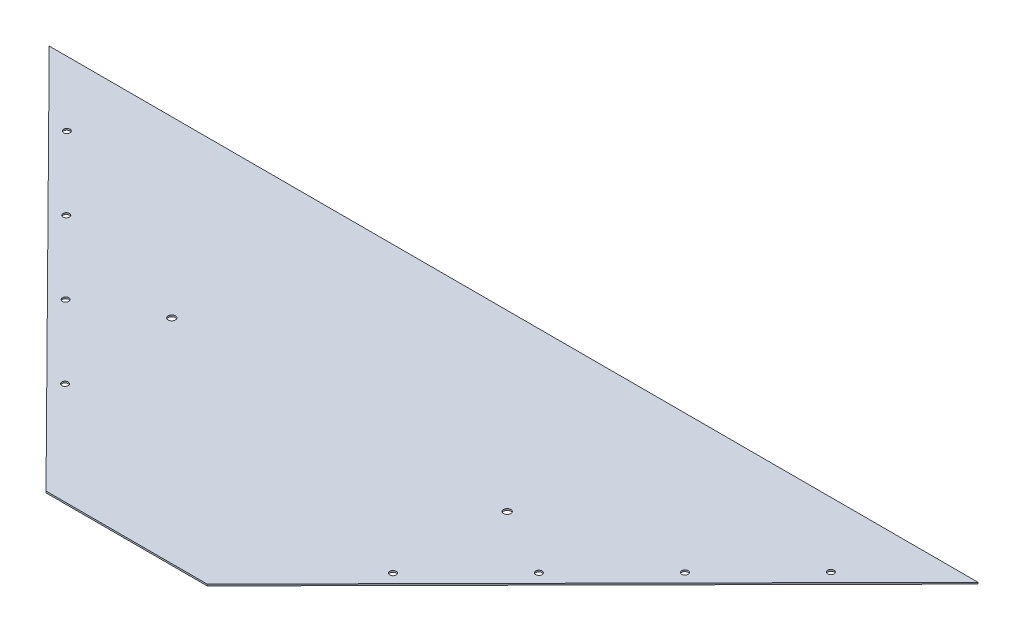
ISO-10303-21;
HEADER;
FILE_DESCRIPTION(('STEP AP214'),'2;1');
FILE_NAME('part.step','',(''),(''),'','','');
FILE_SCHEMA(('AUTOMOTIVE_DESIGN { 1 0 10303 214 1 1 1 1 }'));
ENDSEC;
DATA;
#1=APPLICATION_CONTEXT('core data for automotive mechanical design processes');
#2=APPLICATION_PROTOCOL_DEFINITION('international standard','automotive_design',2000,#1);
#3=PRODUCT_CONTEXT('',#1,'mechanical');
#4=PRODUCT('Part','Part','',(#3));
#5=PRODUCT_RELATED_PRODUCT_CATEGORY('part','',(#4));
#6=PRODUCT_DEFINITION_FORMATION('','',#4);
#7=PRODUCT_DEFINITION_CONTEXT('part definition',#1,'design');
#8=PRODUCT_DEFINITION('design','',#6,#7);
#9=PRODUCT_DEFINITION_SHAPE('','',#8);
#10=(LENGTH_UNIT() NAMED_UNIT(*) SI_UNIT(.MILLI.,.METRE.));
#11=(NAMED_UNIT(*) PLANE_ANGLE_UNIT() SI_UNIT($,.RADIAN.));
#12=(NAMED_UNIT(*) SI_UNIT($,.STERADIAN.) SOLID_ANGLE_UNIT());
#13=UNCERTAINTY_MEASURE_WITH_UNIT(LENGTH_MEASURE(1.E-05),#10,'distance_accuracy_value','');
#14=(GEOMETRIC_REPRESENTATION_CONTEXT(3) GLOBAL_UNCERTAINTY_ASSIGNED_CONTEXT((#13)) GLOBAL_UNIT_ASSIGNED_CONTEXT((#10,
#11,#12)) REPRESENTATION_CONTEXT('',''));
#15=CARTESIAN_POINT('',(0.,0.,0.));
#16=DIRECTION('',(0.,0.,1.));
#17=DIRECTION('',(1.,0.,0.));
#18=AXIS2_PLACEMENT_3D('',#15,#16,#17);
#19=CARTESIAN_POINT('',(-755.65,3.175,-762.));
#20=DIRECTION('',(0.710059171597633,0.,-0.70414201183432));
#21=DIRECTION('',(-0.70414201183432,0.,-0.710059171597633));
#22=AXIS2_PLACEMENT_3D('',#19,#20,#21);
#23=PLANE('',#22);
#24=DIRECTION('',(0.70414201183432,0.,0.710059171597633));
#25=VECTOR('',#24,1.);
#26=CARTESIAN_POINT('',(-755.65,0.,-762.));
#27=LINE('',#26,#25);
#28=CARTESIAN_POINT('',(-755.65,0.,-762.));
#29=VERTEX_POINT('',#28);
#30=CARTESIAN_POINT('',(0.,0.,0.));
#31=VERTEX_POINT('',#30);
#32=EDGE_CURVE('E97',#29,#31,#27,.T.);
#33=ORIENTED_EDGE('',*,*,#32,.T.);
#34=DIRECTION('',(0.,-1.,0.));
#35=VECTOR('',#34,1.);
#36=CARTESIAN_POINT('',(0.,3.175,0.));
#37=LINE('',#36,#35);
#38=CARTESIAN_POINT('',(0.,3.175,0.));
#39=VERTEX_POINT('',#38);
#40=EDGE_CURVE('E11',#39,#31,#37,.T.);
#41=ORIENTED_EDGE('',*,*,#40,.F.);
#42=DIRECTION('',(0.70414201183432,0.,0.710059171597633));
#43=VECTOR('',#42,1.);
#44=CARTESIAN_POINT('',(-755.65,3.175,-762.));
#45=LINE('',#44,#43);
#46=CARTESIAN_POINT('',(-755.65,3.175,-762.));
#47=VERTEX_POINT('',#46);
#48=EDGE_CURVE('E85',#47,#39,#45,.T.);
#49=ORIENTED_EDGE('',*,*,#48,.F.);
#50=DIRECTION('',(0.,-1.,0.));
#51=VECTOR('',#50,1.);
#52=CARTESIAN_POINT('',(-755.65,3.175,-762.));
#53=LINE('',#52,#51);
#54=EDGE_CURVE('E93',#47,#29,#53,.T.);
#55=ORIENTED_EDGE('',*,*,#54,.T.);
#56=EDGE_LOOP('',(#33,#41,#49,#55));
#57=FACE_BOUND('',#56,.T.);
#58=ADVANCED_FACE('F34',(#57),#23,.F.);
#59=CARTESIAN_POINT('',(0.,3.175,0.));
#60=DIRECTION('',(0.,0.,-1.));
#61=DIRECTION('',(-1.,0.,0.));
#62=AXIS2_PLACEMENT_3D('',#59,#60,#61);
#63=PLANE('',#62);
#64=DIRECTION('',(1.,0.,0.));
#65=VECTOR('',#64,1.);
#66=CARTESIAN_POINT('',(0.,0.,0.));
#67=LINE('',#66,#65);
#68=CARTESIAN_POINT('',(317.5,0.,0.));
#69=VERTEX_POINT('',#68);
#70=EDGE_CURVE('E89',#31,#69,#67,.T.);
#71=ORIENTED_EDGE('',*,*,#70,.T.);
#72=DIRECTION('',(0.,-1.,0.));
#73=VECTOR('',#72,1.);
#74=CARTESIAN_POINT('',(317.5,3.175,0.));
#75=LINE('',#74,#73);
#76=CARTESIAN_POINT('',(317.5,3.175,0.));
#77=VERTEX_POINT('',#76);
#78=EDGE_CURVE('E42',#77,#69,#75,.T.);
#79=ORIENTED_EDGE('',*,*,#78,.F.);
#80=DIRECTION('',(1.,0.,0.));
#81=VECTOR('',#80,1.);
#82=CARTESIAN_POINT('',(0.,3.175,0.));
#83=LINE('',#82,#81);
#84=EDGE_CURVE('E80',#39,#77,#83,.T.);
#85=ORIENTED_EDGE('',*,*,#84,.F.);
#86=ORIENTED_EDGE('',*,*,#40,.T.);
#87=EDGE_LOOP('',(#71,#79,#85,#86));
#88=FACE_BOUND('',#87,.T.);
#89=ADVANCED_FACE('F88',(#88),#63,.F.);
#90=CARTESIAN_POINT('',(1073.15,3.175,-762.));
#91=DIRECTION('',(-0.710059171597633,0.,-0.704142011834319));
#92=DIRECTION('',(-0.704142011834319,0.,0.710059171597633));
#93=AXIS2_PLACEMENT_3D('',#90,#91,#92);
#94=PLANE('',#93);
#95=DIRECTION('',(0.704142011834319,0.,-0.710059171597633));
#96=VECTOR('',#95,1.);
#97=CARTESIAN_POINT('',(1073.15,0.,-762.));
#98=LINE('',#97,#96);
#99=CARTESIAN_POINT('',(1073.15,0.,-762.));
#100=VERTEX_POINT('',#99);
#101=EDGE_CURVE('E67',#69,#100,#98,.T.);
#102=ORIENTED_EDGE('',*,*,#101,.T.);
#103=DIRECTION('',(0.,-1.,0.));
#104=VECTOR('',#103,1.);
#105=CARTESIAN_POINT('',(1073.15,3.175,-762.));
#106=LINE('',#105,#104);
#107=CARTESIAN_POINT('',(1073.15,3.175,-762.));
#108=VERTEX_POINT('',#107);
#109=EDGE_CURVE('E90',#108,#100,#106,.T.);
#110=ORIENTED_EDGE('',*,*,#109,.F.);
#111=DIRECTION('',(0.704142011834319,0.,-0.710059171597633));
#112=VECTOR('',#111,1.);
#113=CARTESIAN_POINT('',(1073.15,3.175,-762.));
#114=LINE('',#113,#112);
#115=EDGE_CURVE('E83',#77,#108,#114,.T.);
#116=ORIENTED_EDGE('',*,*,#115,.F.);
#117=ORIENTED_EDGE('',*,*,#78,.T.);
#118=EDGE_LOOP('',(#102,#110,#116,#117));
#119=FACE_BOUND('',#118,.T.);
#120=ADVANCED_FACE('F91',(#119),#94,.F.);
#121=CARTESIAN_POINT('',(1073.15,3.175,-762.));
#122=DIRECTION('',(0.,0.,1.));
#123=DIRECTION('',(1.,0.,0.));
#124=AXIS2_PLACEMENT_3D('',#121,#122,#123);
#125=PLANE('',#124);
#126=DIRECTION('',(-1.,0.,0.));
#127=VECTOR('',#126,1.);
#128=CARTESIAN_POINT('',(1073.15,0.,-762.));
#129=LINE('',#128,#127);
#130=EDGE_CURVE('E73',#100,#29,#129,.T.);
#131=ORIENTED_EDGE('',*,*,#130,.T.);
#132=ORIENTED_EDGE('',*,*,#54,.F.);
#133=DIRECTION('',(-1.,0.,0.));
#134=VECTOR('',#133,1.);
#135=CARTESIAN_POINT('',(1073.15,3.175,-762.));
#136=LINE('',#135,#134);
#137=EDGE_CURVE('E50',#108,#47,#136,.T.);
#138=ORIENTED_EDGE('',*,*,#137,.F.);
#139=ORIENTED_EDGE('',*,*,#109,.T.);
#140=EDGE_LOOP('',(#131,#132,#138,#139));
#141=FACE_BOUND('',#140,.T.);
#142=ADVANCED_FACE('F105',(#141),#125,.F.);
#143=CARTESIAN_POINT('',(158.75,3.175,160.084033613445));
#144=DIRECTION('',(0.,-1.,0.));
#145=DIRECTION('',(0.,0.,-1.));
#146=AXIS2_PLACEMENT_3D('',#143,#144,#145);
#147=PLANE('',#146);
#148=CARTESIAN_POINT('',(910.902017408381,3.175,-634.460857890803));
#149=DIRECTION('',(0.,1.,0.));
#150=DIRECTION('',(0.,0.,-1.));
#151=AXIS2_PLACEMENT_3D('',#148,#149,#150);
#152=CIRCLE('',#151,6.34999999999994);
#153=CARTESIAN_POINT('',(910.902017408381,3.175,-640.810857890803));
#154=VERTEX_POINT('',#153);
#155=EDGE_CURVE('E165',#154,#154,#152,.T.);
#156=ORIENTED_EDGE('',*,*,#155,.F.);
#157=EDGE_LOOP('',(#156));
#158=FACE_BOUND('',#157,.T.);
#159=CARTESIAN_POINT('',(767.820360603647,3.175,-490.176834222165));
#160=DIRECTION('',(0.,1.,0.));
#161=DIRECTION('',(0.,0.,-1.));
#162=AXIS2_PLACEMENT_3D('',#159,#160,#161);
#163=CIRCLE('',#162,6.34999999999994);
#164=CARTESIAN_POINT('',(767.820360603647,3.175,-496.526834222164));
#165=VERTEX_POINT('',#164);
#166=EDGE_CURVE('E159',#165,#165,#163,.T.);
#167=ORIENTED_EDGE('',*,*,#166,.F.);
#168=EDGE_LOOP('',(#167));
#169=FACE_BOUND('',#168,.T.);
#170=CARTESIAN_POINT('',(624.738703798914,3.175,-345.892810553526));
#171=DIRECTION('',(0.,1.,0.));
#172=DIRECTION('',(0.,0.,-1.));
#173=AXIS2_PLACEMENT_3D('',#170,#171,#172);
#174=CIRCLE('',#173,6.34999999999994);
#175=CARTESIAN_POINT('',(624.738703798914,3.175,-352.242810553526));
#176=VERTEX_POINT('',#175);
#177=EDGE_CURVE('E153',#176,#176,#174,.T.);
#178=ORIENTED_EDGE('',*,*,#177,.F.);
#179=EDGE_LOOP('',(#178));
#180=FACE_BOUND('',#179,.T.);
#181=CARTESIAN_POINT('',(481.65704699418,3.175,-201.608786884887));
#182=DIRECTION('',(0.,1.,0.));
#183=DIRECTION('',(0.,0.,-1.));
#184=AXIS2_PLACEMENT_3D('',#181,#182,#183);
#185=CIRCLE('',#184,6.34999999999994);
#186=CARTESIAN_POINT('',(481.65704699418,3.175,-207.958786884887));
#187=VERTEX_POINT('',#186);
#188=EDGE_CURVE('E147',#187,#187,#185,.T.);
#189=ORIENTED_EDGE('',*,*,#188,.F.);
#190=EDGE_LOOP('',(#189));
#191=FACE_BOUND('',#190,.T.);
#192=CARTESIAN_POINT('',(-164.15704699418,3.175,-201.608786884887));
#193=DIRECTION('',(0.,1.,0.));
#194=DIRECTION('',(0.,0.,1.));
#195=AXIS2_PLACEMENT_3D('',#192,#193,#194);
#196=CIRCLE('',#195,6.34999999999994);
#197=CARTESIAN_POINT('',(-164.15704699418,3.175,-195.258786884887));
#198=VERTEX_POINT('',#197);
#199=EDGE_CURVE('E141',#198,#198,#196,.T.);
#200=ORIENTED_EDGE('',*,*,#199,.F.);
#201=EDGE_LOOP('',(#200));
#202=FACE_BOUND('',#201,.T.);
#203=CARTESIAN_POINT('',(-307.238703798914,3.175,-345.892810553526));
#204=DIRECTION('',(0.,1.,0.));
#205=DIRECTION('',(0.,0.,1.));
#206=AXIS2_PLACEMENT_3D('',#203,#204,#205);
#207=CIRCLE('',#206,6.34999999999994);
#208=CARTESIAN_POINT('',(-307.238703798914,3.175,-339.542810553526));
#209=VERTEX_POINT('',#208);
#210=EDGE_CURVE('E135',#209,#209,#207,.T.);
#211=ORIENTED_EDGE('',*,*,#210,.F.);
#212=EDGE_LOOP('',(#211));
#213=FACE_BOUND('',#212,.T.);
#214=CARTESIAN_POINT('',(-450.320360603647,3.175,-490.176834222165));
#215=DIRECTION('',(0.,1.,0.));
#216=DIRECTION('',(0.,0.,1.));
#217=AXIS2_PLACEMENT_3D('',#214,#215,#216);
#218=CIRCLE('',#217,6.34999999999994);
#219=CARTESIAN_POINT('',(-450.320360603647,3.175,-483.826834222165));
#220=VERTEX_POINT('',#219);
#221=EDGE_CURVE('E129',#220,#220,#218,.T.);
#222=ORIENTED_EDGE('',*,*,#221,.F.);
#223=EDGE_LOOP('',(#222));
#224=FACE_BOUND('',#223,.T.);
#225=CARTESIAN_POINT('',(-593.402017408381,3.175,-634.460857890804));
#226=DIRECTION('',(0.,1.,0.));
#227=DIRECTION('',(0.,0.,1.));
#228=AXIS2_PLACEMENT_3D('',#225,#226,#227);
#229=CIRCLE('',#228,6.34999999999994);
#230=CARTESIAN_POINT('',(-593.402017408381,3.175,-628.110857890804));
#231=VERTEX_POINT('',#230);
#232=EDGE_CURVE('E123',#231,#231,#229,.T.);
#233=ORIENTED_EDGE('',*,*,#232,.F.);
#234=EDGE_LOOP('',(#233));
#235=FACE_BOUND('',#234,.T.);
#236=CARTESIAN_POINT('',(488.95,3.175,-419.1));
#237=DIRECTION('',(0.,1.,0.));
#238=DIRECTION('',(0.,0.,1.));
#239=AXIS2_PLACEMENT_3D('',#236,#237,#238);
#240=CIRCLE('',#239,7.14374999999995);
#241=CARTESIAN_POINT('',(488.95,3.175,-411.95625));
#242=VERTEX_POINT('',#241);
#243=EDGE_CURVE('E114',#242,#242,#240,.T.);
#244=ORIENTED_EDGE('',*,*,#243,.F.);
#245=EDGE_LOOP('',(#244));
#246=FACE_BOUND('',#245,.T.);
#247=CARTESIAN_POINT('',(-171.45,3.175,-419.1));
#248=DIRECTION('',(0.,1.,0.));
#249=DIRECTION('',(0.,0.,1.));
#250=AXIS2_PLACEMENT_3D('',#247,#248,#249);
#251=CIRCLE('',#250,7.14374999999993);
#252=CARTESIAN_POINT('',(-171.45,3.175,-411.95625));
#253=VERTEX_POINT('',#252);
#254=EDGE_CURVE('E100',#253,#253,#251,.T.);
#255=ORIENTED_EDGE('',*,*,#254,.F.);
#256=EDGE_LOOP('',(#255));
#257=FACE_BOUND('',#256,.T.);
#258=ORIENTED_EDGE('',*,*,#48,.T.);
#259=ORIENTED_EDGE('',*,*,#84,.T.);
#260=ORIENTED_EDGE('',*,*,#115,.T.);
#261=ORIENTED_EDGE('',*,*,#137,.T.);
#262=EDGE_LOOP('',(#258,#259,#260,#261));
#263=FACE_BOUND('',#262,.T.);
#264=ADVANCED_FACE('F81',(#158,#169,#180,#191,#202,#213,#224,#235,#246,#257,#263),#147,.F.);
#265=CARTESIAN_POINT('',(158.75,0.,160.084033613445));
#266=DIRECTION('',(0.,-1.,0.));
#267=DIRECTION('',(0.,0.,-1.));
#268=AXIS2_PLACEMENT_3D('',#265,#266,#267);
#269=PLANE('',#268);
#270=CARTESIAN_POINT('',(910.902017408381,0.,-634.460857890803));
#271=DIRECTION('',(0.,1.,0.));
#272=DIRECTION('',(0.,0.,-1.));
#273=AXIS2_PLACEMENT_3D('',#270,#271,#272);
#274=CIRCLE('',#273,6.34999999999994);
#275=CARTESIAN_POINT('',(910.902017408381,0.,-640.810857890803));
#276=VERTEX_POINT('',#275);
#277=EDGE_CURVE('E162',#276,#276,#274,.T.);
#278=ORIENTED_EDGE('',*,*,#277,.T.);
#279=EDGE_LOOP('',(#278));
#280=FACE_BOUND('',#279,.T.);
#281=CARTESIAN_POINT('',(767.820360603647,0.,-490.176834222165));
#282=DIRECTION('',(0.,1.,0.));
#283=DIRECTION('',(0.,0.,-1.));
#284=AXIS2_PLACEMENT_3D('',#281,#282,#283);
#285=CIRCLE('',#284,6.34999999999994);
#286=CARTESIAN_POINT('',(767.820360603647,0.,-496.526834222164));
#287=VERTEX_POINT('',#286);
#288=EDGE_CURVE('E156',#287,#287,#285,.T.);
#289=ORIENTED_EDGE('',*,*,#288,.T.);
#290=EDGE_LOOP('',(#289));
#291=FACE_BOUND('',#290,.T.);
#292=CARTESIAN_POINT('',(624.738703798914,0.,-345.892810553526));
#293=DIRECTION('',(0.,1.,0.));
#294=DIRECTION('',(0.,0.,-1.));
#295=AXIS2_PLACEMENT_3D('',#292,#293,#294);
#296=CIRCLE('',#295,6.34999999999994);
#297=CARTESIAN_POINT('',(624.738703798914,0.,-352.242810553526));
#298=VERTEX_POINT('',#297);
#299=EDGE_CURVE('E150',#298,#298,#296,.T.);
#300=ORIENTED_EDGE('',*,*,#299,.T.);
#301=EDGE_LOOP('',(#300));
#302=FACE_BOUND('',#301,.T.);
#303=CARTESIAN_POINT('',(481.65704699418,0.,-201.608786884887));
#304=DIRECTION('',(0.,1.,0.));
#305=DIRECTION('',(0.,0.,-1.));
#306=AXIS2_PLACEMENT_3D('',#303,#304,#305);
#307=CIRCLE('',#306,6.34999999999994);
#308=CARTESIAN_POINT('',(481.65704699418,0.,-207.958786884887));
#309=VERTEX_POINT('',#308);
#310=EDGE_CURVE('E144',#309,#309,#307,.T.);
#311=ORIENTED_EDGE('',*,*,#310,.T.);
#312=EDGE_LOOP('',(#311));
#313=FACE_BOUND('',#312,.T.);
#314=CARTESIAN_POINT('',(-164.15704699418,0.,-201.608786884887));
#315=DIRECTION('',(0.,1.,0.));
#316=DIRECTION('',(0.,0.,1.));
#317=AXIS2_PLACEMENT_3D('',#314,#315,#316);
#318=CIRCLE('',#317,6.34999999999994);
#319=CARTESIAN_POINT('',(-164.15704699418,0.,-195.258786884887));
#320=VERTEX_POINT('',#319);
#321=EDGE_CURVE('E138',#320,#320,#318,.T.);
#322=ORIENTED_EDGE('',*,*,#321,.T.);
#323=EDGE_LOOP('',(#322));
#324=FACE_BOUND('',#323,.T.);
#325=CARTESIAN_POINT('',(-307.238703798914,0.,-345.892810553526));
#326=DIRECTION('',(0.,1.,0.));
#327=DIRECTION('',(0.,0.,1.));
#328=AXIS2_PLACEMENT_3D('',#325,#326,#327);
#329=CIRCLE('',#328,6.34999999999994);
#330=CARTESIAN_POINT('',(-307.238703798914,0.,-339.542810553526));
#331=VERTEX_POINT('',#330);
#332=EDGE_CURVE('E132',#331,#331,#329,.T.);
#333=ORIENTED_EDGE('',*,*,#332,.T.);
#334=EDGE_LOOP('',(#333));
#335=FACE_BOUND('',#334,.T.);
#336=CARTESIAN_POINT('',(-450.320360603647,0.,-490.176834222165));
#337=DIRECTION('',(0.,1.,0.));
#338=DIRECTION('',(0.,0.,1.));
#339=AXIS2_PLACEMENT_3D('',#336,#337,#338);
#340=CIRCLE('',#339,6.34999999999994);
#341=CARTESIAN_POINT('',(-450.320360603647,0.,-483.826834222165));
#342=VERTEX_POINT('',#341);
#343=EDGE_CURVE('E126',#342,#342,#340,.T.);
#344=ORIENTED_EDGE('',*,*,#343,.T.);
#345=EDGE_LOOP('',(#344));
#346=FACE_BOUND('',#345,.T.);
#347=CARTESIAN_POINT('',(-593.402017408381,0.,-634.460857890804));
#348=DIRECTION('',(0.,1.,0.));
#349=DIRECTION('',(0.,0.,1.));
#350=AXIS2_PLACEMENT_3D('',#347,#348,#349);
#351=CIRCLE('',#350,6.34999999999994);
#352=CARTESIAN_POINT('',(-593.402017408381,0.,-628.110857890804));
#353=VERTEX_POINT('',#352);
#354=EDGE_CURVE('E120',#353,#353,#351,.T.);
#355=ORIENTED_EDGE('',*,*,#354,.T.);
#356=EDGE_LOOP('',(#355));
#357=FACE_BOUND('',#356,.T.);
#358=CARTESIAN_POINT('',(488.95,0.,-419.1));
#359=DIRECTION('',(0.,-1.,0.));
#360=DIRECTION('',(0.,0.,-1.));
#361=AXIS2_PLACEMENT_3D('',#358,#359,#360);
#362=CIRCLE('',#361,7.14374999999995);
#363=CARTESIAN_POINT('',(488.95,0.,-426.24375));
#364=VERTEX_POINT('',#363);
#365=EDGE_CURVE('E117',#364,#364,#362,.F.);
#366=ORIENTED_EDGE('',*,*,#365,.T.);
#367=EDGE_LOOP('',(#366));
#368=FACE_BOUND('',#367,.T.);
#369=CARTESIAN_POINT('',(-171.45,0.,-419.1));
#370=DIRECTION('',(0.,-1.,0.));
#371=DIRECTION('',(0.,0.,-1.));
#372=AXIS2_PLACEMENT_3D('',#369,#370,#371);
#373=CIRCLE('',#372,7.14374999999993);
#374=CARTESIAN_POINT('',(-171.45,0.,-426.24375));
#375=VERTEX_POINT('',#374);
#376=EDGE_CURVE('E111',#375,#375,#373,.F.);
#377=ORIENTED_EDGE('',*,*,#376,.T.);
#378=EDGE_LOOP('',(#377));
#379=FACE_BOUND('',#378,.T.);
#380=ORIENTED_EDGE('',*,*,#32,.F.);
#381=ORIENTED_EDGE('',*,*,#130,.F.);
#382=ORIENTED_EDGE('',*,*,#101,.F.);
#383=ORIENTED_EDGE('',*,*,#70,.F.);
#384=EDGE_LOOP('',(#380,#381,#382,#383));
#385=FACE_BOUND('',#384,.T.);
#386=ADVANCED_FACE('F108',(#280,#291,#302,#313,#324,#335,#346,#357,#368,#379,#385),#269,.T.);
#387=CARTESIAN_POINT('',(-171.45,-0.00100000000000013,-419.1));
#388=DIRECTION('',(0.,1.,0.));
#389=DIRECTION('',(0.,0.,1.));
#390=AXIS2_PLACEMENT_3D('',#387,#388,#389);
#391=CYLINDRICAL_SURFACE('',#390,7.14374999999993);
#392=ORIENTED_EDGE('',*,*,#376,.F.);
#393=EDGE_LOOP('',(#392));
#394=FACE_BOUND('',#393,.T.);
#395=ORIENTED_EDGE('',*,*,#254,.T.);
#396=EDGE_LOOP('',(#395));
#397=FACE_BOUND('',#396,.T.);
#398=ADVANCED_FACE('F201',(#394,#397),#391,.F.);
#399=CARTESIAN_POINT('',(488.95,-0.00100000000000013,-419.1));
#400=DIRECTION('',(0.,1.,0.));
#401=DIRECTION('',(0.,0.,1.));
#402=AXIS2_PLACEMENT_3D('',#399,#400,#401);
#403=CYLINDRICAL_SURFACE('',#402,7.14374999999995);
#404=ORIENTED_EDGE('',*,*,#365,.F.);
#405=EDGE_LOOP('',(#404));
#406=FACE_BOUND('',#405,.T.);
#407=ORIENTED_EDGE('',*,*,#243,.T.);
#408=EDGE_LOOP('',(#407));
#409=FACE_BOUND('',#408,.T.);
#410=ADVANCED_FACE('F203',(#406,#409),#403,.F.);
#411=CARTESIAN_POINT('',(-593.402017408381,0.,-634.460857890804));
#412=DIRECTION('',(0.,1.,0.));
#413=DIRECTION('',(0.,0.,1.));
#414=AXIS2_PLACEMENT_3D('',#411,#412,#413);
#415=CYLINDRICAL_SURFACE('',#414,6.34999999999994);
#416=ORIENTED_EDGE('',*,*,#354,.F.);
#417=EDGE_LOOP('',(#416));
#418=FACE_BOUND('',#417,.T.);
#419=ORIENTED_EDGE('',*,*,#232,.T.);
#420=EDGE_LOOP('',(#419));
#421=FACE_BOUND('',#420,.T.);
#422=ADVANCED_FACE('F210',(#418,#421),#415,.F.);
#423=CARTESIAN_POINT('',(-450.320360603647,0.,-490.176834222165));
#424=DIRECTION('',(0.,1.,0.));
#425=DIRECTION('',(0.,0.,1.));
#426=AXIS2_PLACEMENT_3D('',#423,#424,#425);
#427=CYLINDRICAL_SURFACE('',#426,6.34999999999994);
#428=ORIENTED_EDGE('',*,*,#343,.F.);
#429=EDGE_LOOP('',(#428));
#430=FACE_BOUND('',#429,.T.);
#431=ORIENTED_EDGE('',*,*,#221,.T.);
#432=EDGE_LOOP('',(#431));
#433=FACE_BOUND('',#432,.T.);
#434=ADVANCED_FACE('F250',(#430,#433),#427,.F.);
#435=CARTESIAN_POINT('',(-307.238703798914,0.,-345.892810553526));
#436=DIRECTION('',(0.,1.,0.));
#437=DIRECTION('',(0.,0.,1.));
#438=AXIS2_PLACEMENT_3D('',#435,#436,#437);
#439=CYLINDRICAL_SURFACE('',#438,6.34999999999994);
#440=ORIENTED_EDGE('',*,*,#332,.F.);
#441=EDGE_LOOP('',(#440));
#442=FACE_BOUND('',#441,.T.);
#443=ORIENTED_EDGE('',*,*,#210,.T.);
#444=EDGE_LOOP('',(#443));
#445=FACE_BOUND('',#444,.T.);
#446=ADVANCED_FACE('F261',(#442,#445),#439,.F.);
#447=CARTESIAN_POINT('',(-164.15704699418,0.,-201.608786884887));
#448=DIRECTION('',(0.,1.,0.));
#449=DIRECTION('',(0.,0.,1.));
#450=AXIS2_PLACEMENT_3D('',#447,#448,#449);
#451=CYLINDRICAL_SURFACE('',#450,6.34999999999994);
#452=ORIENTED_EDGE('',*,*,#321,.F.);
#453=EDGE_LOOP('',(#452));
#454=FACE_BOUND('',#453,.T.);
#455=ORIENTED_EDGE('',*,*,#199,.T.);
#456=EDGE_LOOP('',(#455));
#457=FACE_BOUND('',#456,.T.);
#458=ADVANCED_FACE('F271',(#454,#457),#451,.F.);
#459=CARTESIAN_POINT('',(481.65704699418,0.,-201.608786884887));
#460=DIRECTION('',(0.,1.,0.));
#461=DIRECTION('',(0.,0.,1.));
#462=AXIS2_PLACEMENT_3D('',#459,#460,#461);
#463=CYLINDRICAL_SURFACE('',#462,6.34999999999994);
#464=ORIENTED_EDGE('',*,*,#310,.F.);
#465=EDGE_LOOP('',(#464));
#466=FACE_BOUND('',#465,.T.);
#467=ORIENTED_EDGE('',*,*,#188,.T.);
#468=EDGE_LOOP('',(#467));
#469=FACE_BOUND('',#468,.T.);
#470=ADVANCED_FACE('F281',(#466,#469),#463,.F.);
#471=CARTESIAN_POINT('',(624.738703798914,0.,-345.892810553526));
#472=DIRECTION('',(0.,1.,0.));
#473=DIRECTION('',(0.,0.,1.));
#474=AXIS2_PLACEMENT_3D('',#471,#472,#473);
#475=CYLINDRICAL_SURFACE('',#474,6.34999999999994);
#476=ORIENTED_EDGE('',*,*,#299,.F.);
#477=EDGE_LOOP('',(#476));
#478=FACE_BOUND('',#477,.T.);
#479=ORIENTED_EDGE('',*,*,#177,.T.);
#480=EDGE_LOOP('',(#479));
#481=FACE_BOUND('',#480,.T.);
#482=ADVANCED_FACE('F291',(#478,#481),#475,.F.);
#483=CARTESIAN_POINT('',(767.820360603647,0.,-490.176834222165));
#484=DIRECTION('',(0.,1.,0.));
#485=DIRECTION('',(0.,0.,1.));
#486=AXIS2_PLACEMENT_3D('',#483,#484,#485);
#487=CYLINDRICAL_SURFACE('',#486,6.34999999999994);
#488=ORIENTED_EDGE('',*,*,#288,.F.);
#489=EDGE_LOOP('',(#488));
#490=FACE_BOUND('',#489,.T.);
#491=ORIENTED_EDGE('',*,*,#166,.T.);
#492=EDGE_LOOP('',(#491));
#493=FACE_BOUND('',#492,.T.);
#494=ADVANCED_FACE('F176',(#490,#493),#487,.F.);
#495=CARTESIAN_POINT('',(910.902017408381,0.,-634.460857890803));
#496=DIRECTION('',(0.,1.,0.));
#497=DIRECTION('',(0.,0.,1.));
#498=AXIS2_PLACEMENT_3D('',#495,#496,#497);
#499=CYLINDRICAL_SURFACE('',#498,6.34999999999994);
#500=ORIENTED_EDGE('',*,*,#277,.F.);
#501=EDGE_LOOP('',(#500));
#502=FACE_BOUND('',#501,.T.);
#503=ORIENTED_EDGE('',*,*,#155,.T.);
#504=EDGE_LOOP('',(#503));
#505=FACE_BOUND('',#504,.T.);
#506=ADVANCED_FACE('F173',(#502,#505),#499,.F.);
#507=CLOSED_SHELL('',(#58,#89,#120,#142,#264,#386,#398,#410,#422,#434,#446,#458,#470,#482,#494,#506));
#508=MANIFOLD_SOLID_BREP('B2',#507);
#509=ADVANCED_BREP_SHAPE_REPRESENTATION('',(#18,#508),#14);
#510=SHAPE_DEFINITION_REPRESENTATION(#9,#509);
ENDSEC;
END-ISO-10303-21;
